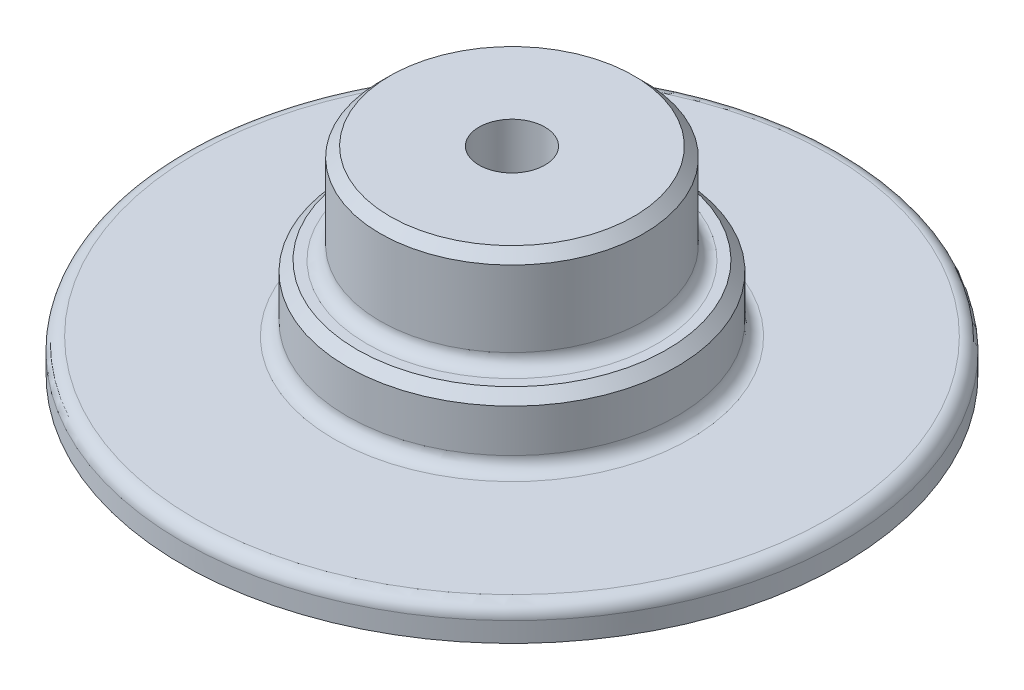
ISO-10303-21;
HEADER;
FILE_DESCRIPTION(('STEP AP214'),'2;1');
FILE_NAME('part.step','',(''),(''),'','','');
FILE_SCHEMA(('AUTOMOTIVE_DESIGN { 1 0 10303 214 1 1 1 1 }'));
ENDSEC;
DATA;
#1=APPLICATION_CONTEXT('core data for automotive mechanical design processes');
#2=APPLICATION_PROTOCOL_DEFINITION('international standard','automotive_design',2000,#1);
#3=PRODUCT_CONTEXT('',#1,'mechanical');
#4=PRODUCT('Part','Part','',(#3));
#5=PRODUCT_RELATED_PRODUCT_CATEGORY('part','',(#4));
#6=PRODUCT_DEFINITION_FORMATION('','',#4);
#7=PRODUCT_DEFINITION_CONTEXT('part definition',#1,'design');
#8=PRODUCT_DEFINITION('design','',#6,#7);
#9=PRODUCT_DEFINITION_SHAPE('','',#8);
#10=(LENGTH_UNIT() NAMED_UNIT(*) SI_UNIT(.MILLI.,.METRE.));
#11=(NAMED_UNIT(*) PLANE_ANGLE_UNIT() SI_UNIT($,.RADIAN.));
#12=(NAMED_UNIT(*) SI_UNIT($,.STERADIAN.) SOLID_ANGLE_UNIT());
#13=UNCERTAINTY_MEASURE_WITH_UNIT(LENGTH_MEASURE(1.E-05),#10,'distance_accuracy_value','');
#14=(GEOMETRIC_REPRESENTATION_CONTEXT(3) GLOBAL_UNCERTAINTY_ASSIGNED_CONTEXT((#13)) GLOBAL_UNIT_ASSIGNED_CONTEXT((#10,
#11,#12)) REPRESENTATION_CONTEXT('',''));
#15=CARTESIAN_POINT('',(0.,0.,0.));
#16=DIRECTION('',(0.,0.,1.));
#17=DIRECTION('',(1.,0.,0.));
#18=AXIS2_PLACEMENT_3D('',#15,#16,#17);
#19=CARTESIAN_POINT('',(-20.,0.,0.));
#20=DIRECTION('',(0.,-1.,0.));
#21=DIRECTION('',(0.,0.,-1.));
#22=AXIS2_PLACEMENT_3D('',#19,#20,#21);
#23=CYLINDRICAL_SURFACE('',#22,200.);
#24=CARTESIAN_POINT('',(-20.,12.,0.));
#25=DIRECTION('',(0.,1.,0.));
#26=DIRECTION('',(0.,0.,1.));
#27=AXIS2_PLACEMENT_3D('',#24,#25,#26);
#28=CIRCLE('',#27,200.);
#29=CARTESIAN_POINT('',(-20.,12.,200.));
#30=VERTEX_POINT('',#29);
#31=EDGE_CURVE('E66',#30,#30,#28,.F.);
#32=ORIENTED_EDGE('',*,*,#31,.T.);
#33=EDGE_LOOP('',(#32));
#34=FACE_BOUND('',#33,.T.);
#35=CARTESIAN_POINT('',(-20.,0.,0.));
#36=DIRECTION('',(0.,-1.,0.));
#37=DIRECTION('',(0.,0.,-1.));
#38=AXIS2_PLACEMENT_3D('',#35,#36,#37);
#39=CIRCLE('',#38,200.);
#40=CARTESIAN_POINT('',(-20.,0.,-200.));
#41=VERTEX_POINT('',#40);
#42=EDGE_CURVE('E69',#41,#41,#39,.T.);
#43=ORIENTED_EDGE('',*,*,#42,.F.);
#44=EDGE_LOOP('',(#43));
#45=FACE_BOUND('',#44,.T.);
#46=ADVANCED_FACE('F31',(#34,#45),#23,.T.);
#47=CARTESIAN_POINT('',(180.,0.,0.));
#48=DIRECTION('',(0.,-1.,0.));
#49=DIRECTION('',(0.,0.,-1.));
#50=AXIS2_PLACEMENT_3D('',#47,#48,#49);
#51=PLANE('',#50);
#52=ORIENTED_EDGE('',*,*,#42,.T.);
#53=EDGE_LOOP('',(#52));
#54=FACE_BOUND('',#53,.T.);
#55=CARTESIAN_POINT('',(-20.,0.,0.));
#56=DIRECTION('',(0.,-1.,0.));
#57=DIRECTION('',(0.,0.,-1.));
#58=AXIS2_PLACEMENT_3D('',#55,#56,#57);
#59=CIRCLE('',#58,20.);
#60=CARTESIAN_POINT('',(-20.,0.,-20.));
#61=VERTEX_POINT('',#60);
#62=EDGE_CURVE('E72',#61,#61,#59,.T.);
#63=ORIENTED_EDGE('',*,*,#62,.F.);
#64=EDGE_LOOP('',(#63));
#65=FACE_BOUND('',#64,.T.);
#66=ADVANCED_FACE('F83',(#54,#65),#51,.T.);
#67=CARTESIAN_POINT('',(-20.,0.,0.));
#68=DIRECTION('',(0.,-1.,0.));
#69=DIRECTION('',(0.,0.,-1.));
#70=AXIS2_PLACEMENT_3D('',#67,#68,#69);
#71=CYLINDRICAL_SURFACE('',#70,20.);
#72=ORIENTED_EDGE('',*,*,#62,.T.);
#73=EDGE_LOOP('',(#72));
#74=FACE_BOUND('',#73,.T.);
#75=CARTESIAN_POINT('',(-20.,120.,0.));
#76=DIRECTION('',(0.,-1.,0.));
#77=DIRECTION('',(0.,0.,-1.));
#78=AXIS2_PLACEMENT_3D('',#75,#76,#77);
#79=CIRCLE('',#78,20.);
#80=CARTESIAN_POINT('',(-20.,120.,-20.));
#81=VERTEX_POINT('',#80);
#82=EDGE_CURVE('E75',#81,#81,#79,.T.);
#83=ORIENTED_EDGE('',*,*,#82,.F.);
#84=EDGE_LOOP('',(#83));
#85=FACE_BOUND('',#84,.T.);
#86=ADVANCED_FACE('F81',(#74,#85),#71,.F.);
#87=CARTESIAN_POINT('',(0.,120.,0.));
#88=DIRECTION('',(0.,1.,0.));
#89=DIRECTION('',(0.,0.,1.));
#90=AXIS2_PLACEMENT_3D('',#87,#88,#89);
#91=PLANE('',#90);
#92=CARTESIAN_POINT('',(-20.,120.,0.));
#93=DIRECTION('',(0.,1.,0.));
#94=DIRECTION('',(0.,0.,1.));
#95=AXIS2_PLACEMENT_3D('',#92,#93,#94);
#96=CIRCLE('',#95,74.);
#97=CARTESIAN_POINT('',(-20.,120.,74.));
#98=VERTEX_POINT('',#97);
#99=EDGE_CURVE('E57',#98,#98,#96,.T.);
#100=ORIENTED_EDGE('',*,*,#99,.T.);
#101=EDGE_LOOP('',(#100));
#102=FACE_BOUND('',#101,.T.);
#103=ORIENTED_EDGE('',*,*,#82,.T.);
#104=EDGE_LOOP('',(#103));
#105=FACE_BOUND('',#104,.T.);
#106=ADVANCED_FACE('F79',(#102,#105),#91,.T.);
#107=CARTESIAN_POINT('',(-20.,0.,0.));
#108=DIRECTION('',(0.,-1.,0.));
#109=DIRECTION('',(0.,0.,-1.));
#110=AXIS2_PLACEMENT_3D('',#107,#108,#109);
#111=CYLINDRICAL_SURFACE('',#110,80.);
#112=CARTESIAN_POINT('',(-20.,68.,0.));
#113=DIRECTION('',(0.,1.,0.));
#114=DIRECTION('',(0.,0.,1.));
#115=AXIS2_PLACEMENT_3D('',#112,#113,#114);
#116=CIRCLE('',#115,80.);
#117=CARTESIAN_POINT('',(-20.,68.,80.));
#118=VERTEX_POINT('',#117);
#119=EDGE_CURVE('E42',#118,#118,#116,.T.);
#120=ORIENTED_EDGE('',*,*,#119,.T.);
#121=EDGE_LOOP('',(#120));
#122=FACE_BOUND('',#121,.T.);
#123=CARTESIAN_POINT('',(-20.,114.,0.));
#124=DIRECTION('',(0.,1.,0.));
#125=DIRECTION('',(0.,0.,1.));
#126=AXIS2_PLACEMENT_3D('',#123,#124,#125);
#127=CIRCLE('',#126,80.);
#128=CARTESIAN_POINT('',(-20.,114.,80.));
#129=VERTEX_POINT('',#128);
#130=EDGE_CURVE('E60',#129,#129,#127,.F.);
#131=ORIENTED_EDGE('',*,*,#130,.T.);
#132=EDGE_LOOP('',(#131));
#133=FACE_BOUND('',#132,.T.);
#134=ADVANCED_FACE('F90',(#122,#133),#111,.T.);
#135=CARTESIAN_POINT('',(60.,60.,0.));
#136=DIRECTION('',(0.,1.,0.));
#137=DIRECTION('',(0.,0.,1.));
#138=AXIS2_PLACEMENT_3D('',#135,#136,#137);
#139=PLANE('',#138);
#140=CARTESIAN_POINT('',(-20.,60.,0.));
#141=DIRECTION('',(0.,1.,0.));
#142=DIRECTION('',(0.,0.,1.));
#143=AXIS2_PLACEMENT_3D('',#140,#141,#142);
#144=CIRCLE('',#143,88.);
#145=CARTESIAN_POINT('',(-20.,60.,88.));
#146=VERTEX_POINT('',#145);
#147=EDGE_CURVE('E46',#146,#146,#144,.F.);
#148=ORIENTED_EDGE('',*,*,#147,.T.);
#149=EDGE_LOOP('',(#148));
#150=FACE_BOUND('',#149,.T.);
#151=CARTESIAN_POINT('',(-20.,60.,0.));
#152=DIRECTION('',(0.,1.,0.));
#153=DIRECTION('',(0.,0.,1.));
#154=AXIS2_PLACEMENT_3D('',#151,#152,#153);
#155=CIRCLE('',#154,94.0000000000001);
#156=CARTESIAN_POINT('',(-20.,60.,94.0000000000001));
#157=VERTEX_POINT('',#156);
#158=EDGE_CURVE('E51',#157,#157,#155,.T.);
#159=ORIENTED_EDGE('',*,*,#158,.T.);
#160=EDGE_LOOP('',(#159));
#161=FACE_BOUND('',#160,.T.);
#162=ADVANCED_FACE('F125',(#150,#161),#139,.T.);
#163=CARTESIAN_POINT('',(-20.,0.,0.));
#164=DIRECTION('',(0.,-1.,0.));
#165=DIRECTION('',(0.,0.,-1.));
#166=AXIS2_PLACEMENT_3D('',#163,#164,#165);
#167=CYLINDRICAL_SURFACE('',#166,100.);
#168=CARTESIAN_POINT('',(-20.,28.,0.));
#169=DIRECTION('',(0.,1.,0.));
#170=DIRECTION('',(0.,0.,1.));
#171=AXIS2_PLACEMENT_3D('',#168,#169,#170);
#172=CIRCLE('',#171,100.);
#173=CARTESIAN_POINT('',(-20.,28.,100.));
#174=VERTEX_POINT('',#173);
#175=EDGE_CURVE('E10',#174,#174,#172,.T.);
#176=ORIENTED_EDGE('',*,*,#175,.T.);
#177=EDGE_LOOP('',(#176));
#178=FACE_BOUND('',#177,.T.);
#179=CARTESIAN_POINT('',(-20.,54.0000000000001,0.));
#180=DIRECTION('',(0.,1.,0.));
#181=DIRECTION('',(0.,0.,1.));
#182=AXIS2_PLACEMENT_3D('',#179,#180,#181);
#183=CIRCLE('',#182,100.);
#184=CARTESIAN_POINT('',(-20.,54.0000000000001,100.));
#185=VERTEX_POINT('',#184);
#186=EDGE_CURVE('E54',#185,#185,#183,.F.);
#187=ORIENTED_EDGE('',*,*,#186,.T.);
#188=EDGE_LOOP('',(#187));
#189=FACE_BOUND('',#188,.T.);
#190=ADVANCED_FACE('F128',(#178,#189),#167,.T.);
#191=CARTESIAN_POINT('',(80.,20.,0.));
#192=DIRECTION('',(0.,1.,0.));
#193=DIRECTION('',(0.,0.,1.));
#194=AXIS2_PLACEMENT_3D('',#191,#192,#193);
#195=PLANE('',#194);
#196=CARTESIAN_POINT('',(-20.,20.,0.));
#197=DIRECTION('',(0.,1.,0.));
#198=DIRECTION('',(0.,0.,1.));
#199=AXIS2_PLACEMENT_3D('',#196,#197,#198);
#200=CIRCLE('',#199,108.);
#201=CARTESIAN_POINT('',(-20.,20.,108.));
#202=VERTEX_POINT('',#201);
#203=EDGE_CURVE('E38',#202,#202,#200,.F.);
#204=ORIENTED_EDGE('',*,*,#203,.T.);
#205=EDGE_LOOP('',(#204));
#206=FACE_BOUND('',#205,.T.);
#207=CARTESIAN_POINT('',(-20.,20.,0.));
#208=DIRECTION('',(0.,1.,0.));
#209=DIRECTION('',(0.,0.,1.));
#210=AXIS2_PLACEMENT_3D('',#207,#208,#209);
#211=CIRCLE('',#210,192.);
#212=CARTESIAN_POINT('',(-20.,20.,192.));
#213=VERTEX_POINT('',#212);
#214=EDGE_CURVE('E63',#213,#213,#211,.T.);
#215=ORIENTED_EDGE('',*,*,#214,.T.);
#216=EDGE_LOOP('',(#215));
#217=FACE_BOUND('',#216,.T.);
#218=ADVANCED_FACE('F106',(#206,#217),#195,.T.);
#219=CARTESIAN_POINT('',(-20.,12.,0.));
#220=DIRECTION('',(0.,1.,0.));
#221=DIRECTION('',(0.,0.,1.));
#222=AXIS2_PLACEMENT_3D('',#219,#220,#221);
#223=TOROIDAL_SURFACE('',#222,192.,8.);
#224=ORIENTED_EDGE('',*,*,#214,.F.);
#225=EDGE_LOOP('',(#224));
#226=FACE_BOUND('',#225,.T.);
#227=ORIENTED_EDGE('',*,*,#31,.F.);
#228=EDGE_LOOP('',(#227));
#229=FACE_BOUND('',#228,.T.);
#230=ADVANCED_FACE('F102',(#226,#229),#223,.T.);
#231=CARTESIAN_POINT('',(-20.,114.,0.));
#232=DIRECTION('',(0.,-1.,0.));
#233=DIRECTION('',(0.,0.,-1.));
#234=AXIS2_PLACEMENT_3D('',#231,#232,#233);
#235=CONICAL_SURFACE('',#234,80.,0.785398163397459);
#236=ORIENTED_EDGE('',*,*,#99,.F.);
#237=EDGE_LOOP('',(#236));
#238=FACE_BOUND('',#237,.T.);
#239=ORIENTED_EDGE('',*,*,#130,.F.);
#240=EDGE_LOOP('',(#239));
#241=FACE_BOUND('',#240,.T.);
#242=ADVANCED_FACE('F105',(#238,#241),#235,.T.);
#243=CARTESIAN_POINT('',(-20.,54.0000000000001,0.));
#244=DIRECTION('',(0.,-1.,0.));
#245=DIRECTION('',(0.,0.,-1.));
#246=AXIS2_PLACEMENT_3D('',#243,#244,#245);
#247=CONICAL_SURFACE('',#246,100.,0.785398163397454);
#248=ORIENTED_EDGE('',*,*,#158,.F.);
#249=EDGE_LOOP('',(#248));
#250=FACE_BOUND('',#249,.T.);
#251=ORIENTED_EDGE('',*,*,#186,.F.);
#252=EDGE_LOOP('',(#251));
#253=FACE_BOUND('',#252,.T.);
#254=ADVANCED_FACE('F110',(#250,#253),#247,.T.);
#255=CARTESIAN_POINT('',(-20.,68.,0.));
#256=DIRECTION('',(0.,1.,0.));
#257=DIRECTION('',(0.,0.,1.));
#258=AXIS2_PLACEMENT_3D('',#255,#256,#257);
#259=TOROIDAL_SURFACE('',#258,88.,8.);
#260=ORIENTED_EDGE('',*,*,#119,.F.);
#261=EDGE_LOOP('',(#260));
#262=FACE_BOUND('',#261,.T.);
#263=ORIENTED_EDGE('',*,*,#147,.F.);
#264=EDGE_LOOP('',(#263));
#265=FACE_BOUND('',#264,.T.);
#266=ADVANCED_FACE('F113',(#262,#265),#259,.F.);
#267=CARTESIAN_POINT('',(-20.,28.,0.));
#268=DIRECTION('',(0.,1.,0.));
#269=DIRECTION('',(0.,0.,1.));
#270=AXIS2_PLACEMENT_3D('',#267,#268,#269);
#271=TOROIDAL_SURFACE('',#270,108.,8.);
#272=ORIENTED_EDGE('',*,*,#175,.F.);
#273=EDGE_LOOP('',(#272));
#274=FACE_BOUND('',#273,.T.);
#275=ORIENTED_EDGE('',*,*,#203,.F.);
#276=EDGE_LOOP('',(#275));
#277=FACE_BOUND('',#276,.T.);
#278=ADVANCED_FACE('F33',(#274,#277),#271,.F.);
#279=CLOSED_SHELL('',(#46,#66,#86,#106,#134,#162,#190,#218,#230,#242,#254,#266,#278));
#280=MANIFOLD_SOLID_BREP('B2',#279);
#281=ADVANCED_BREP_SHAPE_REPRESENTATION('',(#18,#280),#14);
#282=SHAPE_DEFINITION_REPRESENTATION(#9,#281);
ENDSEC;
END-ISO-10303-21;
